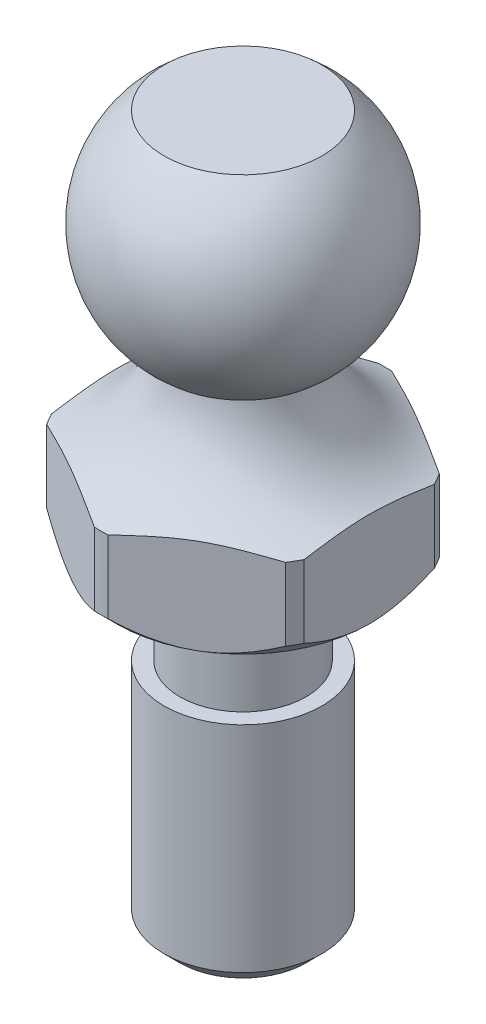
ISO-10303-21;
HEADER;
FILE_DESCRIPTION(('STEP AP214'),'2;1');
FILE_NAME('part.step','',(''),(''),'','','');
FILE_SCHEMA(('AUTOMOTIVE_DESIGN { 1 0 10303 214 1 1 1 1 }'));
ENDSEC;
DATA;
#1=APPLICATION_CONTEXT('core data for automotive mechanical design processes');
#2=APPLICATION_PROTOCOL_DEFINITION('international standard','automotive_design',2000,#1);
#3=PRODUCT_CONTEXT('',#1,'mechanical');
#4=PRODUCT('Part','Part','',(#3));
#5=PRODUCT_RELATED_PRODUCT_CATEGORY('part','',(#4));
#6=PRODUCT_DEFINITION_FORMATION('','',#4);
#7=PRODUCT_DEFINITION_CONTEXT('part definition',#1,'design');
#8=PRODUCT_DEFINITION('design','',#6,#7);
#9=PRODUCT_DEFINITION_SHAPE('','',#8);
#10=(LENGTH_UNIT() NAMED_UNIT(*) SI_UNIT(.MILLI.,.METRE.));
#11=(NAMED_UNIT(*) PLANE_ANGLE_UNIT() SI_UNIT($,.RADIAN.));
#12=(NAMED_UNIT(*) SI_UNIT($,.STERADIAN.) SOLID_ANGLE_UNIT());
#13=UNCERTAINTY_MEASURE_WITH_UNIT(LENGTH_MEASURE(1.E-05),#10,'distance_accuracy_value','');
#14=(GEOMETRIC_REPRESENTATION_CONTEXT(3) GLOBAL_UNCERTAINTY_ASSIGNED_CONTEXT((#13)) GLOBAL_UNIT_ASSIGNED_CONTEXT((#10,
#11,#12)) REPRESENTATION_CONTEXT('',''));
#15=CARTESIAN_POINT('',(0.,0.,0.));
#16=DIRECTION('',(0.,0.,1.));
#17=DIRECTION('',(1.,0.,0.));
#18=AXIS2_PLACEMENT_3D('',#15,#16,#17);
#19=CARTESIAN_POINT('',(-12.9355793572625,2.09126669685807,-0.208376963428236));
#20=DIRECTION('',(0.,1.,0.));
#21=DIRECTION('',(0.,0.,1.));
#22=AXIS2_PLACEMENT_3D('',#19,#20,#21);
#23=PLANE('',#22);
#24=CARTESIAN_POINT('',(-10.435579357209,2.09126669685807,-0.208376963428236));
#25=DIRECTION('',(0.,1.,0.));
#26=DIRECTION('',(0.813826036051074,0.,0.58110858111492));
#27=AXIS2_PLACEMENT_3D('',#24,#25,#26);
#28=CIRCLE('',#27,2.50000000005354);
#29=CARTESIAN_POINT('',(-7.93557935715546,2.09126669685807,-0.208376963428236));
#30=VERTEX_POINT('',#29);
#31=EDGE_CURVE('E399',#30,#30,#28,.T.);
#32=ORIENTED_EDGE('',*,*,#31,.T.);
#33=EDGE_LOOP('',(#32));
#34=FACE_BOUND('',#33,.T.);
#35=ADVANCED_FACE('F16',(#34),#23,.T.);
#36=CARTESIAN_POINT('',(-10.4355793572109,-8.34914185201433,-0.208376963429415));
#37=DIRECTION('',(0.,1.,0.));
#38=DIRECTION('',(0.841190468213112,0.,0.540738935335162));
#39=AXIS2_PLACEMENT_3D('',#36,#37,#38);
#40=CYLINDRICAL_SURFACE('',#39,4.50000000000225);
#41=CARTESIAN_POINT('',(-10.435579357208,-9.49914185214291,-0.208376963427735));
#42=DIRECTION('',(1.87806701130203E-13,-1.,1.08436136602937E-13));
#43=DIRECTION('',(0.841190468213093,2.16616847915806E-13,0.540738935335192));
#44=AXIS2_PLACEMENT_3D('',#41,#42,#43);
#45=CIRCLE('',#44,4.4999999999989);
#46=CARTESIAN_POINT('',(-6.435579357209,-9.49914185209813,1.85317584947618));
#47=VERTEX_POINT('',#46);
#48=CARTESIAN_POINT('',(-6.65022225023739,-9.4991418521269,2.22494824558816));
#49=VERTEX_POINT('',#48);
#50=EDGE_CURVE('E360',#47,#49,#45,.T.);
#51=ORIENTED_EDGE('',*,*,#50,.F.);
#52=DIRECTION('',(0.,-1.,0.));
#53=VECTOR('',#52,1.);
#54=CARTESIAN_POINT('',(-6.435579357209,-7.19914185188673,1.85317584957176));
#55=LINE('',#54,#53);
#56=CARTESIAN_POINT('',(-6.435579357209,-7.19914185188673,1.8531758504963));
#57=VERTEX_POINT('',#56);
#58=EDGE_CURVE('E362',#57,#47,#55,.T.);
#59=ORIENTED_EDGE('',*,*,#58,.F.);
#60=CARTESIAN_POINT('',(-10.4355793572101,-7.19914185211706,-0.208376963428872));
#61=DIRECTION('',(0.,-1.,0.));
#62=DIRECTION('',(0.841190468309558,0.,0.540738935185129));
#63=AXIS2_PLACEMENT_3D('',#60,#61,#62);
#64=CIRCLE('',#63,4.50000000093597);
#65=CARTESIAN_POINT('',(-6.6502222493669,-7.19914185209098,2.22494824519362));
#66=VERTEX_POINT('',#65);
#67=EDGE_CURVE('E26',#57,#66,#64,.T.);
#68=ORIENTED_EDGE('',*,*,#67,.T.);
#69=DIRECTION('',(0.,1.,0.));
#70=VECTOR('',#69,1.);
#71=CARTESIAN_POINT('',(-6.650222250209,-9.4991418521269,2.22494824557176));
#72=LINE('',#71,#70);
#73=EDGE_CURVE('E364',#49,#66,#72,.T.);
#74=ORIENTED_EDGE('',*,*,#73,.F.);
#75=EDGE_LOOP('',(#51,#59,#68,#74));
#76=FACE_BOUND('',#75,.T.);
#77=ADVANCED_FACE('F349',(#76),#40,.T.);
#78=CARTESIAN_POINT('',(-10.4355793572071,-8.34914185187351,-0.20837696342933));
#79=DIRECTION('',(0.,1.,0.));
#80=DIRECTION('',(0.888888888880249,0.,-0.458122847307615));
#81=AXIS2_PLACEMENT_3D('',#78,#79,#80);
#82=CYLINDRICAL_SURFACE('',#81,4.49999999999779);
#83=CARTESIAN_POINT('',(-10.4355793572079,-9.49914185214096,-0.208376963428824));
#84=DIRECTION('',(-1.87811799541566E-13,-1.,1.08427305895431E-13));
#85=DIRECTION('',(0.888888888880244,-2.16616847915811E-13,-0.458122847307625));
#86=AXIS2_PLACEMENT_3D('',#83,#84,#85);
#87=CIRCLE('',#86,4.4999999999988);
#88=CARTESIAN_POINT('',(-6.65022225023739,-9.4991418521269,-2.64170217244462));
#89=VERTEX_POINT('',#88);
#90=CARTESIAN_POINT('',(-6.435579357209,-9.49914185209813,-2.26992977633265));
#91=VERTEX_POINT('',#90);
#92=EDGE_CURVE('E386',#89,#91,#87,.T.);
#93=ORIENTED_EDGE('',*,*,#92,.F.);
#94=DIRECTION('',(0.,-1.,0.));
#95=VECTOR('',#94,1.);
#96=CARTESIAN_POINT('',(-6.650222250209,-7.19914185160509,-2.64170217242823));
#97=LINE('',#96,#95);
#98=CARTESIAN_POINT('',(-6.65022225023739,-7.19914185160509,-2.64170217244462));
#99=VERTEX_POINT('',#98);
#100=EDGE_CURVE('E596',#99,#89,#97,.T.);
#101=ORIENTED_EDGE('',*,*,#100,.F.);
#102=CARTESIAN_POINT('',(-10.4355793572082,-7.19914185214096,-0.208376963428566));
#103=DIRECTION('',(1.87806701139045E-13,1.,-1.08436136589156E-13));
#104=DIRECTION('',(0.841190468213092,-2.16616847915792E-13,-0.540738935335195));
#105=AXIS2_PLACEMENT_3D('',#102,#103,#104);
#106=CIRCLE('',#105,4.49999999999919);
#107=CARTESIAN_POINT('',(-6.435579357209,-7.19914185214416,-2.2699297770974));
#108=VERTEX_POINT('',#107);
#109=EDGE_CURVE('E11',#108,#99,#106,.T.);
#110=ORIENTED_EDGE('',*,*,#109,.F.);
#111=DIRECTION('',(0.,1.,0.));
#112=VECTOR('',#111,1.);
#113=CARTESIAN_POINT('',(-6.435579357209,-9.49914185209813,-2.26992977642823));
#114=LINE('',#113,#112);
#115=EDGE_CURVE('E587',#91,#108,#114,.T.);
#116=ORIENTED_EDGE('',*,*,#115,.F.);
#117=EDGE_LOOP('',(#93,#101,#110,#116));
#118=FACE_BOUND('',#117,.T.);
#119=ADVANCED_FACE('F246',(#118),#82,.T.);
#120=CARTESIAN_POINT('',(-10.435579357209,-8.34914185186729,-0.208376963428499));
#121=DIRECTION('',(0.,1.,0.));
#122=DIRECTION('',(0.0476984207616245,0.,-0.998861782558952));
#123=AXIS2_PLACEMENT_3D('',#120,#121,#122);
#124=CYLINDRICAL_SURFACE('',#123,4.49999999999974);
#125=CARTESIAN_POINT('',(-10.4355793572091,-9.49914185214193,-0.208376963424309));
#126=DIRECTION('',(0.,-1.,0.));
#127=DIRECTION('',(0.0476984207615952,0.,-0.998861782558953));
#128=AXIS2_PLACEMENT_3D('',#125,#126,#127);
#129=CIRCLE('',#128,4.50000000000393);
#130=CARTESIAN_POINT('',(-10.6502222506474,-9.49914185191004,-4.70325498517515));
#131=VERTEX_POINT('',#130);
#132=CARTESIAN_POINT('',(-10.2209364637706,-9.49914185191004,-4.70325498517515));
#133=VERTEX_POINT('',#132);
#134=EDGE_CURVE('E400',#131,#133,#129,.T.);
#135=ORIENTED_EDGE('',*,*,#134,.F.);
#136=DIRECTION('',(0.,-1.,0.));
#137=VECTOR('',#136,1.);
#138=CARTESIAN_POINT('',(-10.650222250209,-7.19914185159265,-4.70325498542824));
#139=LINE('',#138,#137);
#140=CARTESIAN_POINT('',(-10.6502222497639,-7.19914185159265,-4.70325498568521));
#141=VERTEX_POINT('',#140);
#142=EDGE_CURVE('E194',#141,#131,#139,.T.);
#143=ORIENTED_EDGE('',*,*,#142,.F.);
#144=CARTESIAN_POINT('',(-10.4355793572091,-7.19914185211706,-0.208376963427883));
#145=DIRECTION('',(0.,-1.,0.));
#146=DIRECTION('',(6.65604476721615E-11,0.,-1.));
#147=AXIS2_PLACEMENT_3D('',#144,#145,#146);
#148=CIRCLE('',#147,4.50000000093503);
#149=CARTESIAN_POINT('',(-10.2209364640133,-7.19914185201842,-4.70325498531525));
#150=VERTEX_POINT('',#149);
#151=EDGE_CURVE('E183',#141,#150,#148,.T.);
#152=ORIENTED_EDGE('',*,*,#151,.T.);
#153=DIRECTION('',(0.,1.,0.));
#154=VECTOR('',#153,1.);
#155=CARTESIAN_POINT('',(-10.220936464209,-9.49914185191004,-4.70325498542824));
#156=LINE('',#155,#154);
#157=EDGE_CURVE('E218',#133,#150,#156,.T.);
#158=ORIENTED_EDGE('',*,*,#157,.F.);
#159=EDGE_LOOP('',(#135,#143,#152,#158));
#160=FACE_BOUND('',#159,.T.);
#161=ADVANCED_FACE('F243',(#160),#124,.T.);
#162=CARTESIAN_POINT('',(-10.4355793568907,-3.87360990428316,-0.208376963447198));
#163=DIRECTION('',(5.67447117494339E-12,1.,-1.33735931076486E-12));
#164=DIRECTION('',(0.,1.33735931076486E-12,1.));
#165=AXIS2_PLACEMENT_3D('',#162,#163,#164);
#166=TOROIDAL_SURFACE('',#165,5.59125490113747,3.49999999902956);
#167=CARTESIAN_POINT('',(-10.435579357209,-4.3584572575709,-0.208376963428245));
#168=DIRECTION('',(0.,1.,0.));
#169=DIRECTION('',(1.48481270572609E-10,0.,-1.));
#170=AXIS2_PLACEMENT_3D('',#167,#168,#169);
#171=CIRCLE('',#170,2.12500000027852);
#172=CARTESIAN_POINT('',(-10.435579357209,-4.3584572575709,1.9166230368503));
#173=VERTEX_POINT('',#172);
#174=EDGE_CURVE('E394',#173,#173,#171,.T.);
#175=ORIENTED_EDGE('',*,*,#174,.F.);
#176=EDGE_LOOP('',(#175));
#177=FACE_BOUND('',#176,.T.);
#178=ORIENTED_EDGE('',*,*,#151,.F.);
#179=CARTESIAN_POINT('',(-14.2209364648665,-7.19914185198512,-2.64170217204862));
#180=CARTESIAN_POINT('',(-13.5613698600229,-7.0846498734219,-3.02250312896782));
#181=CARTESIAN_POINT('',(-13.3171774460345,-7.05327079465841,-3.16348768494187));
#182=CARTESIAN_POINT('',(-12.8325879327979,-6.99100034057078,-3.44326557090269));
#183=CARTESIAN_POINT('',(-12.4355793573871,-6.99096580860609,-3.6724785788254));
#184=CARTESIAN_POINT('',(-12.039497995627,-6.99093135729082,-3.90115625969716));
#185=CARTESIAN_POINT('',(-11.5539812686733,-7.05327079467825,-4.18146947274729));
#186=CARTESIAN_POINT('',(-11.3103471969271,-7.08455295267177,-4.32213166967745));
#187=CARTESIAN_POINT('',(-10.65022224982,-7.19914185202371,-4.70325498565281));
#188=B_SPLINE_CURVE_WITH_KNOTS('',2,(#179,#180,#181,#182,#183,#184,#185,#186,#187),
.UNSPECIFIED.,.F.,.F.,(3,2,2,2,3),(0.,0.25,0.5,0.75,1.),.UNSPECIFIED.);
#189=CARTESIAN_POINT('',(-14.2209364648464,-7.19914185213924,-2.6417021720602));
#190=VERTEX_POINT('',#189);
#191=EDGE_CURVE('E186',#190,#141,#188,.T.);
#192=ORIENTED_EDGE('',*,*,#191,.F.);
#193=CARTESIAN_POINT('',(-10.4355793572084,-7.19914185214291,-0.208376963427816));
#194=DIRECTION('',(1.87811799533941E-13,1.,1.08427305910023E-13));
#195=DIRECTION('',(-0.888888888880229,2.16616847915719E-13,-0.458122847307655));
#196=AXIS2_PLACEMENT_3D('',#193,#194,#195);
#197=CIRCLE('',#196,4.50000000000071);
#198=CARTESIAN_POINT('',(-14.435579357209,-7.19914185189917,-2.26992977633265));
#199=VERTEX_POINT('',#198);
#200=EDGE_CURVE('E172',#190,#199,#197,.T.);
#201=ORIENTED_EDGE('',*,*,#200,.T.);
#202=CARTESIAN_POINT('',(-14.435579357209,-7.19914185202618,1.85317585046376));
#203=CARTESIAN_POINT('',(-14.435579357209,-7.08464987337224,1.09157393622808));
#204=CARTESIAN_POINT('',(-14.435579357209,-7.05327079462897,0.809604824641281));
#205=CARTESIAN_POINT('',(-14.435579357209,-6.99100034048366,0.250049052557782));
#206=CARTESIAN_POINT('',(-14.435579357209,-6.99096580851707,-0.208376963443029));
#207=CARTESIAN_POINT('',(-14.435579357209,-6.99093135719992,-0.665732324985145));
#208=CARTESIAN_POINT('',(-14.435579357209,-7.05327079454879,-1.22635875076968));
#209=CARTESIAN_POINT('',(-14.435579357209,-7.08455295257251,-1.50768314491719));
#210=CARTESIAN_POINT('',(-14.435579357209,-7.19914185187931,-2.26992977633565));
#211=B_SPLINE_CURVE_WITH_KNOTS('',2,(#202,#203,#204,#205,#206,#207,#208,#209,#210),
.UNSPECIFIED.,.F.,.F.,(3,2,2,2,3),(0.,0.25,0.5,0.75,1.),.UNSPECIFIED.);
#212=CARTESIAN_POINT('',(-14.435579357209,-7.1991418521743,1.85317585044149));
#213=VERTEX_POINT('',#212);
#214=EDGE_CURVE('E334',#213,#199,#211,.T.);
#215=ORIENTED_EDGE('',*,*,#214,.F.);
#216=CARTESIAN_POINT('',(-10.4355793572091,-7.19914185214193,-0.208376963428255));
#217=DIRECTION('',(0.,1.,0.));
#218=DIRECTION('',(-0.841190468213101,0.,0.54073893533518));
#219=AXIS2_PLACEMENT_3D('',#216,#217,#218);
#220=CIRCLE('',#219,4.5);
#221=CARTESIAN_POINT('',(-14.2209364641806,-7.19914185160509,2.22494824558816));
#222=VERTEX_POINT('',#221);
#223=EDGE_CURVE('E165',#213,#222,#220,.T.);
#224=ORIENTED_EDGE('',*,*,#223,.T.);
#225=CARTESIAN_POINT('',(-10.6502222504026,-7.19914185192008,4.28650105845999));
#226=CARTESIAN_POINT('',(-11.3097888547717,-7.08464987342959,3.90570010181474));
#227=CARTESIAN_POINT('',(-11.5539812689603,-7.05327079464387,3.76471554572513));
#228=CARTESIAN_POINT('',(-12.0385707820541,-6.99100034058152,3.48493765984673));
#229=CARTESIAN_POINT('',(-12.4355793573999,-6.99096580861213,3.25572465196153));
#230=CARTESIAN_POINT('',(-12.8316607189823,-6.99093135729217,3.02704697119237));
#231=CARTESIAN_POINT('',(-13.3171774456523,-7.0532707946115,2.74673375830609));
#232=CARTESIAN_POINT('',(-13.5608115177963,-7.08455295264022,2.60607156114623));
#233=CARTESIAN_POINT('',(-14.2209364641476,-7.19914185185896,2.22494824560723));
#234=B_SPLINE_CURVE_WITH_KNOTS('',2,(#225,#226,#227,#228,#229,#230,#231,#232,#233),
.UNSPECIFIED.,.F.,.F.,(3,2,2,2,3),(0.,0.25,0.5,0.75,1.),.UNSPECIFIED.);
#235=CARTESIAN_POINT('',(-10.6502222504038,-7.19914185192888,4.28650105845932));
#236=VERTEX_POINT('',#235);
#237=EDGE_CURVE('E209',#236,#222,#234,.T.);
#238=ORIENTED_EDGE('',*,*,#237,.F.);
#239=CARTESIAN_POINT('',(-10.4355793571874,-7.19914185211032,-0.208376963441928));
#240=DIRECTION('',(1.45836306979969E-11,-1.,9.75515838898632E-13));
#241=DIRECTION('',(-0.0476984207107571,2.78789337235782E-13,0.998861782561381));
#242=AXIS2_PLACEMENT_3D('',#239,#240,#241);
#243=CIRCLE('',#242,4.50000000095201);
#244=CARTESIAN_POINT('',(-10.2209364646541,-7.19914185159265,4.28650105882873));
#245=VERTEX_POINT('',#244);
#246=EDGE_CURVE('E322',#245,#236,#243,.T.);
#247=ORIENTED_EDGE('',*,*,#246,.F.);
#248=CARTESIAN_POINT('',(-6.6502222493875,-7.19914185188989,2.22494824509747));
#249=CARTESIAN_POINT('',(-7.30978885395958,-7.08464987332725,2.60574920185991));
#250=CARTESIAN_POINT('',(-7.55398126816254,-7.05327079453002,2.74673375795784));
#251=CARTESIAN_POINT('',(-8.03857078128017,-6.99100034044543,3.02651164384999));
#252=CARTESIAN_POINT('',(-8.43557935656717,-6.99096580847594,3.2557246517012));
#253=CARTESIAN_POINT('',(-8.83166071846817,-6.99093135715586,3.48440233265433));
#254=CARTESIAN_POINT('',(-9.31717744560787,-7.05327079459896,3.76471554581181));
#255=CARTESIAN_POINT('',(-9.5608115171519,-7.08455295258247,3.90537774262525));
#256=CARTESIAN_POINT('',(-10.2209364645992,-7.19914185201448,4.28650105879704));
#257=B_SPLINE_CURVE_WITH_KNOTS('',2,(#248,#249,#250,#251,#252,#253,#254,#255,#256),
.UNSPECIFIED.,.F.,.F.,(3,2,2,2,3),(0.,0.25,0.5,0.75,1.),.UNSPECIFIED.);
#258=EDGE_CURVE('E140',#66,#245,#257,.T.);
#259=ORIENTED_EDGE('',*,*,#258,.F.);
#260=ORIENTED_EDGE('',*,*,#67,.F.);
#261=CARTESIAN_POINT('',(-6.435579357209,-7.19914185187073,-2.2699297771385));
#262=CARTESIAN_POINT('',(-6.435579357209,-7.08464987317232,-1.50832786313804));
#263=CARTESIAN_POINT('',(-6.435579357209,-7.05327079438091,-1.22635875127136));
#264=CARTESIAN_POINT('',(-6.435579357209,-6.99100034021222,-0.666802979280793));
#265=CARTESIAN_POINT('',(-6.435579357209,-6.99096580824469,-0.208376963443029));
#266=CARTESIAN_POINT('',(-6.435579357209,-6.99093135692657,0.248978398335444));
#267=CARTESIAN_POINT('',(-6.435579357209,-7.05327079439791,0.809604824565686));
#268=CARTESIAN_POINT('',(-6.435579357209,-7.08455295240707,1.09092921825331));
#269=CARTESIAN_POINT('',(-6.435579357209,-7.19914185190146,1.85317585049408));
#270=B_SPLINE_CURVE_WITH_KNOTS('',2,(#261,#262,#263,#264,#265,#266,#267,#268,#269),
.UNSPECIFIED.,.F.,.F.,(3,2,2,2,3),(0.,0.25,0.5,0.75,1.),.UNSPECIFIED.);
#271=EDGE_CURVE('E589',#108,#57,#270,.T.);
#272=ORIENTED_EDGE('',*,*,#271,.F.);
#273=ORIENTED_EDGE('',*,*,#109,.T.);
#274=CARTESIAN_POINT('',(-10.2209364640264,-7.19914185191756,-4.70325498532283));
#275=CARTESIAN_POINT('',(-9.56136985931728,-7.08464987333838,-4.32245402848126));
#276=CARTESIAN_POINT('',(-9.31717744535091,-7.05327079456312,-4.18146947251993));
#277=CARTESIAN_POINT('',(-8.83258793202483,-6.99100034043501,-3.90169158650743));
#278=CARTESIAN_POINT('',(-8.43557935657998,-6.9909658084699,-3.67247857856508));
#279=CARTESIAN_POINT('',(-8.03949799516001,-6.99093135715424,-3.44380089788967));
#280=CARTESIAN_POINT('',(-7.55398126864655,-7.05327079446599,-3.16348768509376));
#281=CARTESIAN_POINT('',(-7.31034719620579,-7.08455295253909,-3.02282548776258));
#282=CARTESIAN_POINT('',(-6.65022225025504,-7.19914185174066,-2.64170217245482));
#283=B_SPLINE_CURVE_WITH_KNOTS('',2,(#274,#275,#276,#277,#278,#279,#280,#281,#282),
.UNSPECIFIED.,.F.,.F.,(3,2,2,2,3),(0.,0.25,0.5,0.75,1.),.UNSPECIFIED.);
#284=EDGE_CURVE('E602',#150,#99,#283,.T.);
#285=ORIENTED_EDGE('',*,*,#284,.F.);
#286=EDGE_LOOP('',(#178,#192,#201,#215,#224,#238,#247,#259,#260,#272,#273,#285));
#287=FACE_BOUND('',#286,.T.);
#288=ADVANCED_FACE('F188',(#177,#287),#166,.F.);
#289=CARTESIAN_POINT('',(-10.4355793572111,-8.34914185202055,-0.208376963429429));
#290=DIRECTION('',(0.,1.,0.));
#291=DIRECTION('',(-0.841190468213091,0.,-0.540738935335196));
#292=AXIS2_PLACEMENT_3D('',#289,#290,#291);
#293=CYLINDRICAL_SURFACE('',#292,4.49999999999759);
#294=CARTESIAN_POINT('',(-10.4355793572087,-9.49914185214291,-0.20837696342811));
#295=DIRECTION('',(-1.87806701130149E-13,-1.,-1.08436136602896E-13));
#296=DIRECTION('',(-0.841190468213111,2.16616847915739E-13,-0.540738935335165));
#297=AXIS2_PLACEMENT_3D('',#294,#295,#296);
#298=CIRCLE('',#297,4.50000000000028);
#299=CARTESIAN_POINT('',(-14.435579357209,-9.49914185209813,-2.26992977633265));
#300=VERTEX_POINT('',#299);
#301=CARTESIAN_POINT('',(-14.2209364641806,-9.4991418521269,-2.64170217244462));
#302=VERTEX_POINT('',#301);
#303=EDGE_CURVE('E406',#300,#302,#298,.T.);
#304=ORIENTED_EDGE('',*,*,#303,.F.);
#305=DIRECTION('',(0.,-1.,0.));
#306=VECTOR('',#305,1.);
#307=CARTESIAN_POINT('',(-14.435579357209,-7.19914185189917,-2.26992977642823));
#308=LINE('',#307,#306);
#309=EDGE_CURVE('E180',#199,#300,#308,.T.);
#310=ORIENTED_EDGE('',*,*,#309,.F.);
#311=ORIENTED_EDGE('',*,*,#200,.F.);
#312=DIRECTION('',(0.,1.,0.));
#313=VECTOR('',#312,1.);
#314=CARTESIAN_POINT('',(-14.220936464209,-9.4991418521269,-2.64170217242823));
#315=LINE('',#314,#313);
#316=EDGE_CURVE('E177',#302,#190,#315,.T.);
#317=ORIENTED_EDGE('',*,*,#316,.F.);
#318=EDGE_LOOP('',(#304,#310,#311,#317));
#319=FACE_BOUND('',#318,.T.);
#320=ADVANCED_FACE('F175',(#319),#293,.T.);
#321=CARTESIAN_POINT('',(-10.4355793572069,-8.34914185187351,-0.208376963429546));
#322=DIRECTION('',(0.,1.,0.));
#323=DIRECTION('',(-0.88888888888022,0.,0.458122847307671));
#324=AXIS2_PLACEMENT_3D('',#321,#322,#323);
#325=CYLINDRICAL_SURFACE('',#324,4.50000000000251);
#326=CARTESIAN_POINT('',(-10.4355793572107,-9.49914185214096,-0.208376963427363));
#327=DIRECTION('',(1.87811799541594E-13,-1.,-1.08427305895447E-13));
#328=DIRECTION('',(-0.888888888880239,-2.16616847915844E-13,0.458122847307635));
#329=AXIS2_PLACEMENT_3D('',#326,#327,#328);
#330=CIRCLE('',#329,4.4999999999981);
#331=CARTESIAN_POINT('',(-14.2209364641806,-9.4991418521269,2.22494824558816));
#332=VERTEX_POINT('',#331);
#333=CARTESIAN_POINT('',(-14.435579357209,-9.49914185209813,1.85317584947618));
#334=VERTEX_POINT('',#333);
#335=EDGE_CURVE('E415',#332,#334,#330,.T.);
#336=ORIENTED_EDGE('',*,*,#335,.F.);
#337=DIRECTION('',(0.,-1.,0.));
#338=VECTOR('',#337,1.);
#339=CARTESIAN_POINT('',(-14.220936464209,-7.19914185160509,2.22494824557176));
#340=LINE('',#339,#338);
#341=EDGE_CURVE('E202',#222,#332,#340,.T.);
#342=ORIENTED_EDGE('',*,*,#341,.F.);
#343=ORIENTED_EDGE('',*,*,#223,.F.);
#344=DIRECTION('',(0.,1.,0.));
#345=VECTOR('',#344,1.);
#346=CARTESIAN_POINT('',(-14.435579357209,-9.49914185209813,1.85317584957176));
#347=LINE('',#346,#345);
#348=EDGE_CURVE('E368',#334,#213,#347,.T.);
#349=ORIENTED_EDGE('',*,*,#348,.F.);
#350=EDGE_LOOP('',(#336,#342,#343,#349));
#351=FACE_BOUND('',#350,.T.);
#352=ADVANCED_FACE('F456',(#351),#325,.T.);
#353=CARTESIAN_POINT('',(-8.43557935699334,-6.99096580508677,3.25572465194726));
#354=DIRECTION('',(0.50000000006328,0.,0.866025403747904));
#355=DIRECTION('',(0.,-1.,0.));
#356=AXIS2_PLACEMENT_3D('',#353,#354,#355);
#357=PLANE('',#356);
#358=CARTESIAN_POINT('',(-8.43557935613269,-9.99914185182822,3.25572465145035));
#359=CARTESIAN_POINT('',(-7.5954113062662,-9.9991418516416,2.77065340161357));
#360=CARTESIAN_POINT('',(-6.65022225023739,-9.4991418521269,2.22494824558815));
#361=(BOUNDED_CURVE() B_SPLINE_CURVE(2,(#358,#359,#360),.UNSPECIFIED.,.F.,
.F.) B_SPLINE_CURVE_WITH_KNOTS((3,3),(-0.801266375007275,-0.464903587661062),
.UNSPECIFIED.) CURVE() GEOMETRIC_REPRESENTATION_ITEM() RATIONAL_B_SPLINE_CURVE((1.50105540524149,
1.50105540520647,1.41275802851874)) REPRESENTATION_ITEM(''));
#362=CARTESIAN_POINT('',(-8.43557935630825,-9.99914185214192,3.2557246513706));
#363=VERTEX_POINT('',#362);
#364=EDGE_CURVE('E380',#363,#49,#361,.T.);
#365=ORIENTED_EDGE('',*,*,#364,.T.);
#366=ORIENTED_EDGE('',*,*,#73,.T.);
#367=ORIENTED_EDGE('',*,*,#258,.T.);
#368=DIRECTION('',(0.,-1.,0.));
#369=VECTOR('',#368,1.);
#370=CARTESIAN_POINT('',(-10.220936464209,-7.19914185159265,4.28650105857176));
#371=LINE('',#370,#369);
#372=CARTESIAN_POINT('',(-10.2209364637706,-9.49914185191004,4.28650105831867));
#373=VERTEX_POINT('',#372);
#374=EDGE_CURVE('E575',#245,#373,#371,.T.);
#375=ORIENTED_EDGE('',*,*,#374,.T.);
#376=CARTESIAN_POINT('',(-10.2209364637706,-9.49914185191003,4.28650105831867));
#377=CARTESIAN_POINT('',(-9.2757474067978,-9.99914185201484,3.74079590174824));
#378=CARTESIAN_POINT('',(-8.43557935613269,-9.99914185182822,3.25572465145035));
#379=(BOUNDED_CURVE() B_SPLINE_CURVE(2,(#376,#377,#378),.UNSPECIFIED.,.F.,
.F.) B_SPLINE_CURVE_WITH_KNOTS((3,3),(-1.13762916268891,-0.801266375046162),
.UNSPECIFIED.) CURVE() GEOMETRIC_REPRESENTATION_ITEM() RATIONAL_B_SPLINE_CURVE((1.41275802848269,
1.5010554052765,1.50105540524149)) REPRESENTATION_ITEM(''));
#380=EDGE_CURVE('E511',#373,#363,#379,.T.);
#381=ORIENTED_EDGE('',*,*,#380,.T.);
#382=EDGE_LOOP('',(#365,#366,#367,#375,#381));
#383=FACE_BOUND('',#382,.T.);
#384=ADVANCED_FACE('F445',(#383),#357,.T.);
#385=CARTESIAN_POINT('',(-6.435579357209,-6.99096580485727,-0.208376963322206));
#386=DIRECTION('',(1.,0.,0.));
#387=DIRECTION('',(0.,-1.,0.));
#388=AXIS2_PLACEMENT_3D('',#385,#386,#387);
#389=PLANE('',#388);
#390=CARTESIAN_POINT('',(-6.435579357209,-9.99914185214191,-0.208376963885483));
#391=CARTESIAN_POINT('',(-6.435579357209,-9.99914185203105,-1.17851946385562));
#392=CARTESIAN_POINT('',(-6.435579357209,-9.49914185209813,-2.26992977633265));
#393=(BOUNDED_CURVE() B_SPLINE_CURVE(2,(#390,#391,#392),.UNSPECIFIED.,.F.,
.F.) B_SPLINE_CURVE_WITH_KNOTS((3,3),(-0.801266375081924,-0.464903587580177),
.UNSPECIFIED.) CURVE() GEOMETRIC_REPRESENTATION_ITEM() RATIONAL_B_SPLINE_CURVE((1.50105540532457,
1.50105540530377,1.4127580285335)) REPRESENTATION_ITEM(''));
#394=CARTESIAN_POINT('',(-6.435579357209,-9.99914185214192,-0.208376963838443));
#395=VERTEX_POINT('',#394);
#396=EDGE_CURVE('E404',#395,#91,#393,.T.);
#397=ORIENTED_EDGE('',*,*,#396,.T.);
#398=ORIENTED_EDGE('',*,*,#115,.T.);
#399=ORIENTED_EDGE('',*,*,#271,.T.);
#400=ORIENTED_EDGE('',*,*,#58,.T.);
#401=CARTESIAN_POINT('',(-6.435579357209,-9.49914185209813,1.85317584947617));
#402=CARTESIAN_POINT('',(-6.435579357209,-9.99914185225281,0.761765536515004));
#403=CARTESIAN_POINT('',(-6.435579357209,-9.99914185214191,-0.208376963885483));
#404=(BOUNDED_CURVE() B_SPLINE_CURVE(2,(#401,#402,#403),.UNSPECIFIED.,.F.,
.F.) B_SPLINE_CURVE_WITH_KNOTS((3,3),(-1.13762916277482,-0.801266375114544),
.UNSPECIFIED.) CURVE() GEOMETRIC_REPRESENTATION_ITEM() RATIONAL_B_SPLINE_CURVE((1.4127580285335,
1.50105540534538,1.50105540532457)) REPRESENTATION_ITEM(''));
#405=EDGE_CURVE('E369',#47,#395,#404,.T.);
#406=ORIENTED_EDGE('',*,*,#405,.T.);
#407=EDGE_LOOP('',(#397,#398,#399,#400,#406));
#408=FACE_BOUND('',#407,.T.);
#409=ADVANCED_FACE('F455',(#408),#389,.T.);
#410=CARTESIAN_POINT('',(-8.43557935714073,-6.99096580508129,-3.67247857888883));
#411=DIRECTION('',(0.500000000063281,0.,-0.866025403747904));
#412=DIRECTION('',(0.,1.,0.));
#413=AXIS2_PLACEMENT_3D('',#410,#411,#412);
#414=PLANE('',#413);
#415=CARTESIAN_POINT('',(-8.43557935712751,-9.99914185182821,-3.6724785788812));
#416=CARTESIAN_POINT('',(-9.27574740732448,-9.9991418517362,-4.15754982890879));
#417=CARTESIAN_POINT('',(-10.2209364637706,-9.49914185191004,-4.70325498517515));
#418=(BOUNDED_CURVE() B_SPLINE_CURVE(2,(#415,#416,#417),.UNSPECIFIED.,.F.,
.F.) B_SPLINE_CURVE_WITH_KNOTS((3,3),(-0.801266375047163,-0.464903587586226),
.UNSPECIFIED.) CURVE() GEOMETRIC_REPRESENTATION_ITEM() RATIONAL_B_SPLINE_CURVE((1.50105540523477,
1.50105540521751,1.41275802847637)) REPRESENTATION_ITEM(''));
#419=CARTESIAN_POINT('',(-8.43557935707837,-9.99914185198507,-3.67247857885282));
#420=VERTEX_POINT('',#419);
#421=EDGE_CURVE('E409',#420,#133,#418,.T.);
#422=ORIENTED_EDGE('',*,*,#421,.T.);
#423=ORIENTED_EDGE('',*,*,#157,.T.);
#424=ORIENTED_EDGE('',*,*,#284,.T.);
#425=ORIENTED_EDGE('',*,*,#100,.T.);
#426=CARTESIAN_POINT('',(-6.65022225023739,-9.49914185212691,-2.64170217244462));
#427=CARTESIAN_POINT('',(-7.59541130679288,-9.99914185192023,-3.18740732877412));
#428=CARTESIAN_POINT('',(-8.43557935712751,-9.99914185182821,-3.6724785788812));
#429=(BOUNDED_CURVE() B_SPLINE_CURVE(2,(#426,#427,#428),.UNSPECIFIED.,.F.,
.F.) B_SPLINE_CURVE_WITH_KNOTS((3,3),(-1.13762916261031,-0.801266375086519),
.UNSPECIFIED.) CURVE() GEOMETRIC_REPRESENTATION_ITEM() RATIONAL_B_SPLINE_CURVE((1.41275802851242,
1.50105540525203,1.50105540523477)) REPRESENTATION_ITEM(''));
#430=EDGE_CURVE('E414',#89,#420,#429,.T.);
#431=ORIENTED_EDGE('',*,*,#430,.T.);
#432=EDGE_LOOP('',(#422,#423,#424,#425,#431));
#433=FACE_BOUND('',#432,.T.);
#434=ADVANCED_FACE('F240',(#433),#414,.T.);
#435=CARTESIAN_POINT('',(-12.4355793573433,-6.99096580521692,-3.67247857885071));
#436=DIRECTION('',(-0.500000000063279,0.,-0.866025403747905));
#437=DIRECTION('',(-0.866025403747905,0.,0.500000000063279));
#438=AXIS2_PLACEMENT_3D('',#435,#436,#437);
#439=PLANE('',#438);
#440=CARTESIAN_POINT('',(-12.4355793571366,-9.99914185182822,-3.67247857897001));
#441=CARTESIAN_POINT('',(-13.2757474075437,-9.99914185196331,-3.18740732882114));
#442=CARTESIAN_POINT('',(-14.2209364641806,-9.49914185212691,-2.64170217244463));
#443=(BOUNDED_CURVE() B_SPLINE_CURVE(2,(#440,#441,#442),.UNSPECIFIED.,.F.,
.F.) B_SPLINE_CURVE_WITH_KNOTS((3,3),(-0.801266375223286,-0.464903587659592),
.UNSPECIFIED.) CURVE() GEOMETRIC_REPRESENTATION_ITEM() RATIONAL_B_SPLINE_CURVE((1.50105540523989,
1.50105540526524,1.41275802851724)) REPRESENTATION_ITEM(''));
#444=CARTESIAN_POINT('',(-12.4355793570882,-9.99914185214192,-3.67247857881685));
#445=VERTEX_POINT('',#444);
#446=EDGE_CURVE('E200',#445,#302,#443,.T.);
#447=ORIENTED_EDGE('',*,*,#446,.T.);
#448=ORIENTED_EDGE('',*,*,#316,.T.);
#449=ORIENTED_EDGE('',*,*,#191,.T.);
#450=ORIENTED_EDGE('',*,*,#142,.T.);
#451=CARTESIAN_POINT('',(-10.6502222506474,-9.49914185191005,-4.70325498517515));
#452=CARTESIAN_POINT('',(-11.5954113070121,-9.99914185169313,-4.15754982895581));
#453=CARTESIAN_POINT('',(-12.4355793571366,-9.99914185182822,-3.67247857897001));
#454=(BOUNDED_CURVE() B_SPLINE_CURVE(2,(#451,#452,#453),.UNSPECIFIED.,.F.,
.F.) B_SPLINE_CURVE_WITH_KNOTS((3,3),(-1.13762916268655,-0.801266375223286),
.UNSPECIFIED.) CURVE() GEOMETRIC_REPRESENTATION_ITEM() RATIONAL_B_SPLINE_CURVE((1.41275802848119,
1.50105540521455,1.50105540523989)) REPRESENTATION_ITEM(''));
#455=EDGE_CURVE('E405',#131,#445,#454,.T.);
#456=ORIENTED_EDGE('',*,*,#455,.T.);
#457=EDGE_LOOP('',(#447,#448,#449,#450,#456));
#458=FACE_BOUND('',#457,.T.);
#459=ADVANCED_FACE('F198',(#458),#439,.T.);
#460=CARTESIAN_POINT('',(-12.4355793572751,-6.9909658052235,3.25572465203362));
#461=DIRECTION('',(-0.500000000063281,0.,0.866025403747903));
#462=DIRECTION('',(0.,1.,0.));
#463=AXIS2_PLACEMENT_3D('',#460,#461,#462);
#464=PLANE('',#463);
#465=CARTESIAN_POINT('',(-12.435579355967,-9.99914185182822,3.25572465278886));
#466=CARTESIAN_POINT('',(-11.5954113063928,-9.99914185136556,3.74079590245685));
#467=CARTESIAN_POINT('',(-10.6502222506473,-9.49914185191004,4.28650105831867));
#468=(BOUNDED_CURVE() B_SPLINE_CURVE(2,(#465,#466,#467),.UNSPECIFIED.,.F.,
.F.) B_SPLINE_CURVE_WITH_KNOTS((3,3),(-0.801266374805013,-0.464903587588607),
.UNSPECIFIED.) CURVE() GEOMETRIC_REPRESENTATION_ITEM() RATIONAL_B_SPLINE_CURVE((1.50105540523736,
1.50105540515055,1.41275802847881)) REPRESENTATION_ITEM(''));
#469=CARTESIAN_POINT('',(-12.4355793560542,-9.99914185198507,3.25572465255738));
#470=VERTEX_POINT('',#469);
#471=CARTESIAN_POINT('',(-10.6502222506474,-9.49914185191004,4.28650105831867));
#472=VERTEX_POINT('',#471);
#473=EDGE_CURVE('E567',#470,#472,#468,.T.);
#474=ORIENTED_EDGE('',*,*,#473,.T.);
#475=DIRECTION('',(0.,1.,0.));
#476=VECTOR('',#475,1.);
#477=CARTESIAN_POINT('',(-10.650222250209,-9.49914185191004,4.28650105857176));
#478=LINE('',#477,#476);
#479=EDGE_CURVE('E156',#472,#236,#478,.T.);
#480=ORIENTED_EDGE('',*,*,#479,.T.);
#481=ORIENTED_EDGE('',*,*,#237,.T.);
#482=ORIENTED_EDGE('',*,*,#341,.T.);
#483=CARTESIAN_POINT('',(-14.2209364641806,-9.49914185212691,2.22494824558816));
#484=CARTESIAN_POINT('',(-13.2757474069244,-9.99914185229087,2.77065340232218));
#485=CARTESIAN_POINT('',(-12.435579355967,-9.99914185182822,3.25572465278886));
#486=(BOUNDED_CURVE() B_SPLINE_CURVE(2,(#483,#484,#485),.UNSPECIFIED.,.F.,
.F.) B_SPLINE_CURVE_WITH_KNOTS((3,3),(-1.13762916261413,-0.80126637487132),
.UNSPECIFIED.) CURVE() GEOMETRIC_REPRESENTATION_ITEM() RATIONAL_B_SPLINE_CURVE((1.41275802851485,
1.50105540532417,1.50105540523736)) REPRESENTATION_ITEM(''));
#487=EDGE_CURVE('E419',#332,#470,#486,.T.);
#488=ORIENTED_EDGE('',*,*,#487,.T.);
#489=EDGE_LOOP('',(#474,#480,#481,#482,#488));
#490=FACE_BOUND('',#489,.T.);
#491=ADVANCED_FACE('F229',(#490),#464,.T.);
#492=CARTESIAN_POINT('',(-14.435579357209,-6.99096580512964,-0.208376962935941));
#493=DIRECTION('',(-1.,0.,0.));
#494=DIRECTION('',(0.,0.,-1.));
#495=AXIS2_PLACEMENT_3D('',#492,#493,#494);
#496=PLANE('',#495);
#497=CARTESIAN_POINT('',(-14.435579357209,-9.99914185214191,-0.208376964297376));
#498=CARTESIAN_POINT('',(-14.435579357209,-9.99914185235272,0.761765536296946));
#499=CARTESIAN_POINT('',(-14.435579357209,-9.49914185209813,1.85317584947617));
#500=(BOUNDED_CURVE() B_SPLINE_CURVE(2,(#497,#498,#499),.UNSPECIFIED.,.F.,
.F.) B_SPLINE_CURVE_WITH_KNOTS((3,3),(-0.801266375295836,-0.464903587581903),
.UNSPECIFIED.) CURVE() GEOMETRIC_REPRESENTATION_ITEM() RATIONAL_B_SPLINE_CURVE((1.50105540532645,
1.501055405366,1.41275802853526)) REPRESENTATION_ITEM(''));
#501=CARTESIAN_POINT('',(-14.435579357209,-9.99914185214192,-0.208376964197616));
#502=VERTEX_POINT('',#501);
#503=EDGE_CURVE('E440',#502,#334,#500,.T.);
#504=ORIENTED_EDGE('',*,*,#503,.T.);
#505=ORIENTED_EDGE('',*,*,#348,.T.);
#506=ORIENTED_EDGE('',*,*,#214,.T.);
#507=ORIENTED_EDGE('',*,*,#309,.T.);
#508=CARTESIAN_POINT('',(-14.435579357209,-9.49914185209813,-2.26992977633265));
#509=CARTESIAN_POINT('',(-14.435579357209,-9.99914185193114,-1.17851946407368));
#510=CARTESIAN_POINT('',(-14.435579357209,-9.99914185214191,-0.208376964297376));
#511=(BOUNDED_CURVE() B_SPLINE_CURVE(2,(#508,#509,#510),.UNSPECIFIED.,.F.,
.F.) B_SPLINE_CURVE_WITH_KNOTS((3,3),(-1.1376291627776,-0.801266375295836),
.UNSPECIFIED.) CURVE() GEOMETRIC_REPRESENTATION_ITEM() RATIONAL_B_SPLINE_CURVE((1.41275802853526,
1.5010554052869,1.50105540532645)) REPRESENTATION_ITEM(''));
#512=EDGE_CURVE('E410',#300,#502,#511,.T.);
#513=ORIENTED_EDGE('',*,*,#512,.T.);
#514=EDGE_LOOP('',(#504,#505,#506,#507,#513));
#515=FACE_BOUND('',#514,.T.);
#516=ADVANCED_FACE('F239',(#515),#496,.T.);
#517=CARTESIAN_POINT('',(-10.435579357209,-9.54914185210998,-0.208376963428202));
#518=DIRECTION('',(0.,1.,0.));
#519=DIRECTION('',(0.584991902568791,0.,0.811039132181023));
#520=AXIS2_PLACEMENT_3D('',#517,#518,#519);
#521=CONICAL_SURFACE('',#520,4.45000000003197,0.78539816340001);
#522=ORIENTED_EDGE('',*,*,#364,.F.);
#523=CARTESIAN_POINT('',(-10.435579357209,-9.99914185214191,-0.208376963428234));
#524=DIRECTION('',(0.,1.,0.));
#525=DIRECTION('',(1.,0.,-1.02552238753008E-10));
#526=AXIS2_PLACEMENT_3D('',#523,#524,#525);
#527=CIRCLE('',#526,4.);
#528=EDGE_CURVE('E374',#363,#395,#527,.T.);
#529=ORIENTED_EDGE('',*,*,#528,.T.);
#530=ORIENTED_EDGE('',*,*,#405,.F.);
#531=ORIENTED_EDGE('',*,*,#50,.T.);
#532=EDGE_LOOP('',(#522,#529,#530,#531));
#533=FACE_BOUND('',#532,.T.);
#534=ADVANCED_FACE('F347',(#533),#521,.T.);
#535=CARTESIAN_POINT('',(-10.4355793572088,-9.54914185210268,-0.208376963428293));
#536=DIRECTION('',(0.,1.,0.));
#537=DIRECTION('',(0.994876443229693,0.,-0.101098282411892));
#538=AXIS2_PLACEMENT_3D('',#535,#536,#537);
#539=CONICAL_SURFACE('',#538,4.45000000003925,0.785398163400037);
#540=ORIENTED_EDGE('',*,*,#396,.F.);
#541=CARTESIAN_POINT('',(-10.435579357209,-9.99914185214191,-0.208376963428238));
#542=DIRECTION('',(0.,1.,0.));
#543=DIRECTION('',(0.499999999993443,0.,-0.866025403788225));
#544=AXIS2_PLACEMENT_3D('',#541,#542,#543);
#545=CIRCLE('',#544,4.);
#546=EDGE_CURVE('E481',#395,#420,#545,.T.);
#547=ORIENTED_EDGE('',*,*,#546,.T.);
#548=ORIENTED_EDGE('',*,*,#430,.F.);
#549=ORIENTED_EDGE('',*,*,#92,.T.);
#550=EDGE_LOOP('',(#540,#547,#548,#549));
#551=FACE_BOUND('',#550,.T.);
#552=ADVANCED_FACE('F461',(#551),#539,.T.);
#553=CARTESIAN_POINT('',(-10.435579357209,-9.54914185193327,-0.208376963428283));
#554=DIRECTION('',(0.,1.,0.));
#555=DIRECTION('',(0.409884540852513,0.,-0.91213741463122));
#556=AXIS2_PLACEMENT_3D('',#553,#554,#555);
#557=CONICAL_SURFACE('',#556,4.45000000020865,0.78539816340001);
#558=ORIENTED_EDGE('',*,*,#421,.F.);
#559=CARTESIAN_POINT('',(-10.435579357209,-9.99914185214191,-0.208376963428246));
#560=DIRECTION('',(0.,1.,0.));
#561=DIRECTION('',(-0.499999999950194,0.,-0.866025403813194));
#562=AXIS2_PLACEMENT_3D('',#559,#560,#561);
#563=CIRCLE('',#562,4.);
#564=EDGE_CURVE('E429',#420,#445,#563,.T.);
#565=ORIENTED_EDGE('',*,*,#564,.T.);
#566=ORIENTED_EDGE('',*,*,#455,.F.);
#567=ORIENTED_EDGE('',*,*,#134,.T.);
#568=EDGE_LOOP('',(#558,#565,#566,#567));
#569=FACE_BOUND('',#568,.T.);
#570=ADVANCED_FACE('F266',(#569),#557,.T.);
#571=CARTESIAN_POINT('',(-10.435579357209,-9.54914185210251,-0.208376963428238));
#572=DIRECTION('',(0.,1.,0.));
#573=DIRECTION('',(-0.584991902322371,0.,-0.811039132358762));
#574=AXIS2_PLACEMENT_3D('',#571,#572,#573);
#575=CONICAL_SURFACE('',#574,4.45000000003942,0.785398163399993);
#576=ORIENTED_EDGE('',*,*,#446,.F.);
#577=CARTESIAN_POINT('',(-10.435579357209,-9.99914185214192,-0.208376963428241));
#578=DIRECTION('',(0.,1.,0.));
#579=DIRECTION('',(-1.,0.,-1.92343718560041E-10));
#580=AXIS2_PLACEMENT_3D('',#577,#578,#579);
#581=CIRCLE('',#580,4.);
#582=EDGE_CURVE('E321',#445,#502,#581,.T.);
#583=ORIENTED_EDGE('',*,*,#582,.T.);
#584=ORIENTED_EDGE('',*,*,#512,.F.);
#585=ORIENTED_EDGE('',*,*,#303,.T.);
#586=EDGE_LOOP('',(#576,#583,#584,#585));
#587=FACE_BOUND('',#586,.T.);
#588=ADVANCED_FACE('F262',(#587),#575,.T.);
#589=CARTESIAN_POINT('',(-10.4355793572091,-9.54914185211664,-0.208376963428201));
#590=DIRECTION('',(0.,1.,0.));
#591=DIRECTION('',(-0.994876443255633,0.,0.101098282156625));
#592=AXIS2_PLACEMENT_3D('',#589,#590,#591);
#593=CONICAL_SURFACE('',#592,4.4500000000253,0.785398163400012);
#594=ORIENTED_EDGE('',*,*,#503,.F.);
#595=CARTESIAN_POINT('',(-10.435579357209,-9.99914185214194,-0.208376963428242));
#596=DIRECTION('',(0.,1.,0.));
#597=DIRECTION('',(-0.499999999691682,0.,0.866025403962446));
#598=AXIS2_PLACEMENT_3D('',#595,#596,#597);
#599=CIRCLE('',#598,4.);
#600=EDGE_CURVE('E437',#502,#470,#599,.T.);
#601=ORIENTED_EDGE('',*,*,#600,.T.);
#602=ORIENTED_EDGE('',*,*,#487,.F.);
#603=ORIENTED_EDGE('',*,*,#335,.T.);
#604=EDGE_LOOP('',(#594,#601,#602,#603));
#605=FACE_BOUND('',#604,.T.);
#606=ADVANCED_FACE('F265',(#605),#593,.T.);
#607=CARTESIAN_POINT('',(-14.4355793576532,-9.99914185214192,-0.208376963463932));
#608=DIRECTION('',(0.,-1.,0.));
#609=DIRECTION('',(1.,0.,0.));
#610=AXIS2_PLACEMENT_3D('',#607,#608,#609);
#611=PLANE('',#610);
#612=CARTESIAN_POINT('',(-10.435579357209,-9.99914185225271,-0.208376963428236));
#613=DIRECTION('',(0.,1.,0.));
#614=DIRECTION('',(0.,0.,-1.));
#615=AXIS2_PLACEMENT_3D('',#612,#613,#614);
#616=CIRCLE('',#615,2.40000000033675);
#617=CARTESIAN_POINT('',(-10.435579357209,-9.99914185225271,2.19162303690327));
#618=VERTEX_POINT('',#617);
#619=EDGE_CURVE('E528',#618,#618,#616,.T.);
#620=ORIENTED_EDGE('',*,*,#619,.T.);
#621=EDGE_LOOP('',(#620));
#622=FACE_BOUND('',#621,.T.);
#623=ORIENTED_EDGE('',*,*,#582,.F.);
#624=ORIENTED_EDGE('',*,*,#564,.F.);
#625=ORIENTED_EDGE('',*,*,#546,.F.);
#626=ORIENTED_EDGE('',*,*,#528,.F.);
#627=CARTESIAN_POINT('',(-10.435579357209,-9.99914185214194,-0.208376963428217));
#628=DIRECTION('',(0.,1.,0.));
#629=DIRECTION('',(0.500000000205584,0.,0.866025403665745));
#630=AXIS2_PLACEMENT_3D('',#627,#628,#629);
#631=CIRCLE('',#630,4.);
#632=EDGE_CURVE('E521',#470,#363,#631,.T.);
#633=ORIENTED_EDGE('',*,*,#632,.F.);
#634=ORIENTED_EDGE('',*,*,#600,.F.);
#635=EDGE_LOOP('',(#623,#624,#625,#626,#633,#634));
#636=FACE_BOUND('',#635,.T.);
#637=ADVANCED_FACE('F276',(#622,#636),#611,.T.);
#638=CARTESIAN_POINT('',(-12.935579357209,-12.9991418521419,-0.208376963428236));
#639=DIRECTION('',(0.,1.,0.));
#640=DIRECTION('',(0.,0.,1.));
#641=AXIS2_PLACEMENT_3D('',#638,#639,#640);
#642=PLANE('',#641);
#643=CARTESIAN_POINT('',(-10.435579357209,-12.9991418521419,-0.208376963428235));
#644=DIRECTION('',(0.,1.,0.));
#645=DIRECTION('',(0.,0.,1.));
#646=AXIS2_PLACEMENT_3D('',#643,#644,#645);
#647=CIRCLE('',#646,2.);
#648=CARTESIAN_POINT('',(-10.435579357209,-12.9991418521419,1.79162303657177));
#649=VERTEX_POINT('',#648);
#650=EDGE_CURVE('E392',#649,#649,#647,.T.);
#651=ORIENTED_EDGE('',*,*,#650,.F.);
#652=EDGE_LOOP('',(#651));
#653=FACE_BOUND('',#652,.T.);
#654=CARTESIAN_POINT('',(-10.435579357209,-12.9991418521419,-0.208376963428236));
#655=DIRECTION('',(0.,1.,0.));
#656=DIRECTION('',(0.,0.,-1.));
#657=AXIS2_PLACEMENT_3D('',#654,#655,#656);
#658=CIRCLE('',#657,2.5);
#659=CARTESIAN_POINT('',(-10.435579357209,-12.9991418521419,2.29162303657176));
#660=VERTEX_POINT('',#659);
#661=EDGE_CURVE('E435',#660,#660,#658,.T.);
#662=ORIENTED_EDGE('',*,*,#661,.T.);
#663=EDGE_LOOP('',(#662));
#664=FACE_BOUND('',#663,.T.);
#665=ADVANCED_FACE('F273',(#653,#664),#642,.T.);
#666=CARTESIAN_POINT('',(-12.435579357209,-20.299141852142,-0.208376963428236));
#667=DIRECTION('',(0.,-1.,0.));
#668=DIRECTION('',(1.,0.,0.));
#669=AXIS2_PLACEMENT_3D('',#666,#667,#668);
#670=PLANE('',#669);
#671=CARTESIAN_POINT('',(-10.435579357209,-20.299141852142,-0.208376963428237));
#672=DIRECTION('',(0.,-1.,0.));
#673=DIRECTION('',(0.,0.,-1.));
#674=AXIS2_PLACEMENT_3D('',#671,#672,#673);
#675=CIRCLE('',#674,2.);
#676=CARTESIAN_POINT('',(-10.435579357209,-20.299141852142,1.79162303657179));
#677=VERTEX_POINT('',#676);
#678=EDGE_CURVE('E436',#677,#677,#675,.T.);
#679=ORIENTED_EDGE('',*,*,#678,.T.);
#680=EDGE_LOOP('',(#679));
#681=FACE_BOUND('',#680,.T.);
#682=ADVANCED_FACE('F272',(#681),#670,.T.);
#683=CARTESIAN_POINT('',(-10.435579357209,-8.34914185186729,-0.2083769634281));
#684=DIRECTION('',(0.,1.,0.));
#685=DIRECTION('',(-0.0476984207616238,0.,0.998861782558952));
#686=AXIS2_PLACEMENT_3D('',#683,#684,#685);
#687=CYLINDRICAL_SURFACE('',#686,4.49999999999987);
#688=CARTESIAN_POINT('',(-10.435579357209,-9.49914185214193,-0.208376963427835));
#689=DIRECTION('',(0.,-1.,0.));
#690=DIRECTION('',(-0.0476984207616289,0.,0.998861782558952));
#691=AXIS2_PLACEMENT_3D('',#688,#689,#690);
#692=CIRCLE('',#691,4.49999999999961);
#693=EDGE_CURVE('E520',#373,#472,#692,.T.);
#694=ORIENTED_EDGE('',*,*,#693,.F.);
#695=ORIENTED_EDGE('',*,*,#374,.F.);
#696=ORIENTED_EDGE('',*,*,#246,.T.);
#697=ORIENTED_EDGE('',*,*,#479,.F.);
#698=EDGE_LOOP('',(#694,#695,#696,#697));
#699=FACE_BOUND('',#698,.T.);
#700=ADVANCED_FACE('F268',(#699),#687,.T.);
#701=CARTESIAN_POINT('',(-10.435579357209,-9.54914185193325,-0.208376963428197));
#702=DIRECTION('',(0.,1.,0.));
#703=DIRECTION('',(-0.409884540536786,0.,0.912137414773097));
#704=AXIS2_PLACEMENT_3D('',#701,#702,#703);
#705=CONICAL_SURFACE('',#704,4.45000000020868,0.78539816340001);
#706=ORIENTED_EDGE('',*,*,#632,.T.);
#707=ORIENTED_EDGE('',*,*,#380,.F.);
#708=ORIENTED_EDGE('',*,*,#693,.T.);
#709=ORIENTED_EDGE('',*,*,#473,.F.);
#710=EDGE_LOOP('',(#706,#707,#708,#709));
#711=FACE_BOUND('',#710,.T.);
#712=ADVANCED_FACE('F271',(#711),#705,.T.);
#713=CARTESIAN_POINT('',(-10.435579357209,-10.3991418524682,-0.208376963428237));
#714=DIRECTION('',(0.,1.,0.));
#715=DIRECTION('',(0.,0.,1.));
#716=AXIS2_PLACEMENT_3D('',#713,#714,#715);
#717=TOROIDAL_SURFACE('',#716,2.40000000032627,0.40000000021548);
#718=ORIENTED_EDGE('',*,*,#619,.F.);
#719=EDGE_LOOP('',(#718));
#720=FACE_BOUND('',#719,.T.);
#721=CARTESIAN_POINT('',(-10.435579357209,-10.3991418521419,-0.208376963428237));
#722=DIRECTION('',(0.,1.,0.));
#723=DIRECTION('',(0.,0.,-1.));
#724=AXIS2_PLACEMENT_3D('',#721,#722,#723);
#725=CIRCLE('',#724,2.);
#726=CARTESIAN_POINT('',(-10.435579357209,-10.3991418521419,1.79162303657177));
#727=VERTEX_POINT('',#726);
#728=EDGE_CURVE('E522',#727,#727,#725,.T.);
#729=ORIENTED_EDGE('',*,*,#728,.T.);
#730=EDGE_LOOP('',(#729));
#731=FACE_BOUND('',#730,.T.);
#732=ADVANCED_FACE('F257',(#720,#731),#717,.F.);
#733=CARTESIAN_POINT('',(-10.435579357209,-11.6991418521419,-0.208376963428235));
#734=DIRECTION('',(0.,1.,0.));
#735=DIRECTION('',(0.,0.,-1.));
#736=AXIS2_PLACEMENT_3D('',#733,#734,#735);
#737=CYLINDRICAL_SURFACE('',#736,2.);
#738=ORIENTED_EDGE('',*,*,#728,.F.);
#739=EDGE_LOOP('',(#738));
#740=FACE_BOUND('',#739,.T.);
#741=ORIENTED_EDGE('',*,*,#650,.T.);
#742=EDGE_LOOP('',(#741));
#743=FACE_BOUND('',#742,.T.);
#744=ADVANCED_FACE('F254',(#740,#743),#737,.T.);
#745=CARTESIAN_POINT('',(-10.435579357209,-16.3991418521419,-0.208376963428236));
#746=DIRECTION('',(0.,1.,0.));
#747=DIRECTION('',(0.,0.,-1.));
#748=AXIS2_PLACEMENT_3D('',#745,#746,#747);
#749=CYLINDRICAL_SURFACE('',#748,2.5);
#750=ORIENTED_EDGE('',*,*,#661,.F.);
#751=EDGE_LOOP('',(#750));
#752=FACE_BOUND('',#751,.T.);
#753=CARTESIAN_POINT('',(-10.435579357209,-19.799141852142,-0.208376963428236));
#754=DIRECTION('',(0.,1.,0.));
#755=DIRECTION('',(0.,0.,-1.));
#756=AXIS2_PLACEMENT_3D('',#753,#754,#755);
#757=CIRCLE('',#756,2.5);
#758=CARTESIAN_POINT('',(-10.435579357209,-19.799141852142,2.29162303657176));
#759=VERTEX_POINT('',#758);
#760=EDGE_CURVE('E431',#759,#759,#757,.T.);
#761=ORIENTED_EDGE('',*,*,#760,.T.);
#762=EDGE_LOOP('',(#761));
#763=FACE_BOUND('',#762,.T.);
#764=ADVANCED_FACE('F252',(#752,#763),#749,.T.);
#765=CARTESIAN_POINT('',(-10.435579357209,-19.849141852142,-0.208376963428237));
#766=DIRECTION('',(0.,1.,0.));
#767=DIRECTION('',(-0.581108581114921,0.,-0.813826036051074));
#768=AXIS2_PLACEMENT_3D('',#765,#766,#767);
#769=CONICAL_SURFACE('',#768,2.45,0.785398163399959);
#770=ORIENTED_EDGE('',*,*,#760,.F.);
#771=EDGE_LOOP('',(#770));
#772=FACE_BOUND('',#771,.T.);
#773=ORIENTED_EDGE('',*,*,#678,.F.);
#774=EDGE_LOOP('',(#773));
#775=FACE_BOUND('',#774,.T.);
#776=ADVANCED_FACE('F248',(#772,#775),#769,.T.);
#777=CARTESIAN_POINT('',(-10.435579357209,-0.999141852141932,-0.208376963428225));
#778=DIRECTION('',(0.,0.,1.));
#779=DIRECTION('',(0.,-1.,0.));
#780=AXIS2_PLACEMENT_3D('',#777,#778,#779);
#781=SPHERICAL_SURFACE('',#780,3.975);
#782=CARTESIAN_POINT('',(-10.435579357209,-0.999141852141932,-0.208376963428225));
#783=DIRECTION('',(0.,1.,0.));
#784=DIRECTION('',(0.813826036051074,0.,0.58110858111492));
#785=AXIS2_PLACEMENT_3D('',#782,#783,#784);
#786=SPHERICAL_SURFACE('',#785,3.975);
#787=ORIENTED_EDGE('',*,*,#31,.F.);
#788=EDGE_LOOP('',(#787));
#789=FACE_BOUND('',#788,.T.);
#790=ORIENTED_EDGE('',*,*,#174,.T.);
#791=EDGE_LOOP('',(#790));
#792=FACE_BOUND('',#791,.T.);
#793=ADVANCED_FACE('F251',(#789,#792),#786,.T.);
#794=CLOSED_SHELL('',(#35,#77,#119,#161,#288,#320,#352,#384,#409,#434,#459,#491,#516,#534,#552,
#570,#588,#606,#637,#665,#682,#700,#712,#732,#744,#764,#776,#793));
#795=MANIFOLD_SOLID_BREP('B1',#794);
#796=ADVANCED_BREP_SHAPE_REPRESENTATION('',(#18,#795),#14);
#797=SHAPE_DEFINITION_REPRESENTATION(#9,#796);
ENDSEC;
END-ISO-10303-21;
